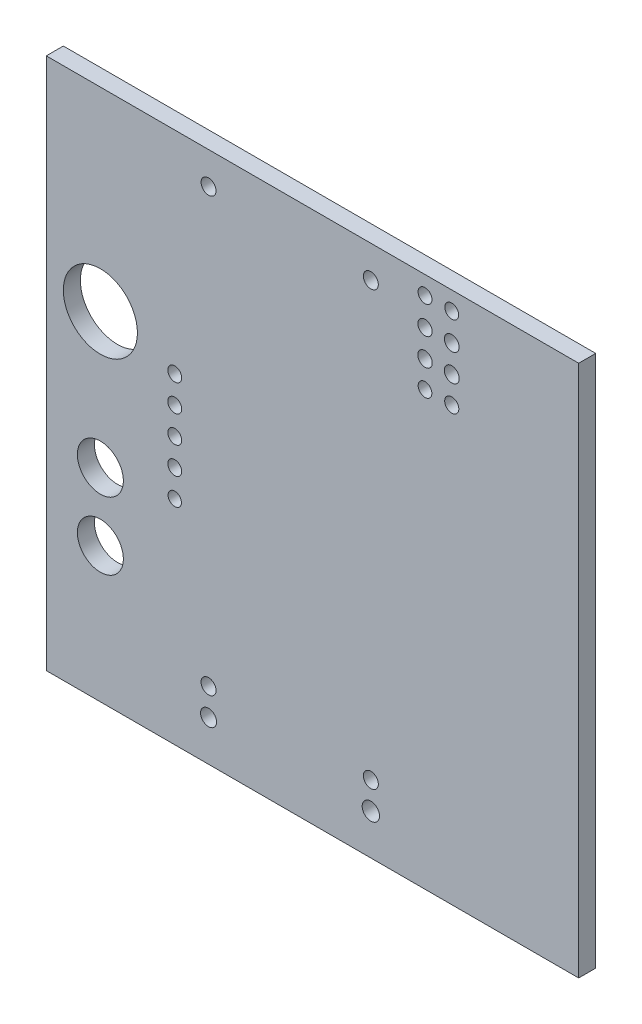
ISO-10303-21;
HEADER;
FILE_DESCRIPTION(('STEP AP214'),'2;1');
FILE_NAME('part.step','',(''),(''),'','','');
FILE_SCHEMA(('AUTOMOTIVE_DESIGN { 1 0 10303 214 1 1 1 1 }'));
ENDSEC;
DATA;
#1=APPLICATION_CONTEXT('core data for automotive mechanical design processes');
#2=APPLICATION_PROTOCOL_DEFINITION('international standard','automotive_design',2000,#1);
#3=PRODUCT_CONTEXT('',#1,'mechanical');
#4=PRODUCT('Part','Part','',(#3));
#5=PRODUCT_RELATED_PRODUCT_CATEGORY('part','',(#4));
#6=PRODUCT_DEFINITION_FORMATION('','',#4);
#7=PRODUCT_DEFINITION_CONTEXT('part definition',#1,'design');
#8=PRODUCT_DEFINITION('design','',#6,#7);
#9=PRODUCT_DEFINITION_SHAPE('','',#8);
#10=(LENGTH_UNIT() NAMED_UNIT(*) SI_UNIT(.MILLI.,.METRE.));
#11=(NAMED_UNIT(*) PLANE_ANGLE_UNIT() SI_UNIT($,.RADIAN.));
#12=(NAMED_UNIT(*) SI_UNIT($,.STERADIAN.) SOLID_ANGLE_UNIT());
#13=UNCERTAINTY_MEASURE_WITH_UNIT(LENGTH_MEASURE(1.E-05),#10,'distance_accuracy_value','');
#14=(GEOMETRIC_REPRESENTATION_CONTEXT(3) GLOBAL_UNCERTAINTY_ASSIGNED_CONTEXT((#13)) GLOBAL_UNIT_ASSIGNED_CONTEXT((#10,
#11,#12)) REPRESENTATION_CONTEXT('',''));
#15=CARTESIAN_POINT('',(0.,0.,0.));
#16=DIRECTION('',(0.,0.,1.));
#17=DIRECTION('',(1.,0.,0.));
#18=AXIS2_PLACEMENT_3D('',#15,#16,#17);
#19=CARTESIAN_POINT('',(0.,0.,1.6));
#20=DIRECTION('',(0.,0.,1.));
#21=DIRECTION('',(1.,0.,0.));
#22=AXIS2_PLACEMENT_3D('',#19,#20,#21);
#23=PLANE('',#22);
#24=CARTESIAN_POINT('',(30.48,3.81,1.6));
#25=DIRECTION('',(0.,0.,1.));
#26=DIRECTION('',(1.,0.,0.));
#27=AXIS2_PLACEMENT_3D('',#24,#25,#26);
#28=CIRCLE('',#27,0.813817080246663);
#29=CARTESIAN_POINT('',(31.2938170802467,3.81,1.6));
#30=VERTEX_POINT('',#29);
#31=EDGE_CURVE('E238',#30,#30,#28,.F.);
#32=ORIENTED_EDGE('',*,*,#31,.T.);
#33=EDGE_LOOP('',(#32));
#34=FACE_BOUND('',#33,.T.);
#35=CARTESIAN_POINT('',(15.24,3.81,1.6));
#36=DIRECTION('',(0.,0.,1.));
#37=DIRECTION('',(1.,0.,0.));
#38=AXIS2_PLACEMENT_3D('',#35,#36,#37);
#39=CIRCLE('',#38,0.75);
#40=CARTESIAN_POINT('',(15.99,3.81,1.6));
#41=VERTEX_POINT('',#40);
#42=EDGE_CURVE('E232',#41,#41,#39,.F.);
#43=ORIENTED_EDGE('',*,*,#42,.T.);
#44=EDGE_LOOP('',(#43));
#45=FACE_BOUND('',#44,.T.);
#46=CARTESIAN_POINT('',(15.24,46.99,1.6));
#47=DIRECTION('',(0.,0.,1.));
#48=DIRECTION('',(1.,0.,0.));
#49=AXIS2_PLACEMENT_3D('',#46,#47,#48);
#50=CIRCLE('',#49,0.704000000000003);
#51=CARTESIAN_POINT('',(15.944,46.99,1.6));
#52=VERTEX_POINT('',#51);
#53=EDGE_CURVE('E217',#52,#52,#50,.T.);
#54=ORIENTED_EDGE('',*,*,#53,.F.);
#55=EDGE_LOOP('',(#54));
#56=FACE_BOUND('',#55,.T.);
#57=CARTESIAN_POINT('',(15.24,6.35,1.6));
#58=DIRECTION('',(0.,0.,1.));
#59=DIRECTION('',(1.,0.,0.));
#60=AXIS2_PLACEMENT_3D('',#57,#58,#59);
#61=CIRCLE('',#60,0.704);
#62=CARTESIAN_POINT('',(15.944,6.35,1.6));
#63=VERTEX_POINT('',#62);
#64=EDGE_CURVE('E205',#63,#63,#61,.T.);
#65=ORIENTED_EDGE('',*,*,#64,.F.);
#66=EDGE_LOOP('',(#65));
#67=FACE_BOUND('',#66,.T.);
#68=CARTESIAN_POINT('',(5.08005587439719,12.6999582986829,1.6));
#69=DIRECTION('',(0.,0.,1.));
#70=DIRECTION('',(1.,0.,0.));
#71=AXIS2_PLACEMENT_3D('',#68,#69,#70);
#72=CIRCLE('',#71,2.1590419406458);
#73=CARTESIAN_POINT('',(7.23909781504299,12.6999582986829,1.6));
#74=VERTEX_POINT('',#73);
#75=EDGE_CURVE('E193',#74,#74,#72,.T.);
#76=ORIENTED_EDGE('',*,*,#75,.F.);
#77=EDGE_LOOP('',(#76));
#78=FACE_BOUND('',#77,.T.);
#79=CARTESIAN_POINT('',(12.065,20.0025,1.6));
#80=DIRECTION('',(0.,0.,1.));
#81=DIRECTION('',(1.,0.,0.));
#82=AXIS2_PLACEMENT_3D('',#79,#80,#81);
#83=CIRCLE('',#82,0.628256736205113);
#84=CARTESIAN_POINT('',(12.6932567362051,20.0025,1.6));
#85=VERTEX_POINT('',#84);
#86=EDGE_CURVE('E181',#85,#85,#83,.T.);
#87=ORIENTED_EDGE('',*,*,#86,.F.);
#88=EDGE_LOOP('',(#87));
#89=FACE_BOUND('',#88,.T.);
#90=CARTESIAN_POINT('',(12.065,27.6225,1.6));
#91=DIRECTION('',(0.,0.,1.));
#92=DIRECTION('',(1.,0.,0.));
#93=AXIS2_PLACEMENT_3D('',#90,#91,#92);
#94=CIRCLE('',#93,0.654);
#95=CARTESIAN_POINT('',(12.719,27.6225,1.6));
#96=VERTEX_POINT('',#95);
#97=EDGE_CURVE('E169',#96,#96,#94,.T.);
#98=ORIENTED_EDGE('',*,*,#97,.F.);
#99=EDGE_LOOP('',(#98));
#100=FACE_BOUND('',#99,.T.);
#101=CARTESIAN_POINT('',(12.065,22.5425,1.6));
#102=DIRECTION('',(0.,0.,1.));
#103=DIRECTION('',(1.,0.,0.));
#104=AXIS2_PLACEMENT_3D('',#101,#102,#103);
#105=CIRCLE('',#104,0.653999999999999);
#106=CARTESIAN_POINT('',(12.719,22.5425,1.6));
#107=VERTEX_POINT('',#106);
#108=EDGE_CURVE('E157',#107,#107,#105,.T.);
#109=ORIENTED_EDGE('',*,*,#108,.F.);
#110=EDGE_LOOP('',(#109));
#111=FACE_BOUND('',#110,.T.);
#112=CARTESIAN_POINT('',(35.5673174372232,45.6860727150293,1.6));
#113=DIRECTION('',(0.,0.,1.));
#114=DIRECTION('',(1.,0.,0.));
#115=AXIS2_PLACEMENT_3D('',#112,#113,#114);
#116=CIRCLE('',#115,0.672816827078109);
#117=CARTESIAN_POINT('',(36.2401342643014,45.6860727150293,1.6));
#118=VERTEX_POINT('',#117);
#119=EDGE_CURVE('E145',#118,#118,#116,.T.);
#120=ORIENTED_EDGE('',*,*,#119,.F.);
#121=EDGE_LOOP('',(#120));
#122=FACE_BOUND('',#121,.T.);
#123=CARTESIAN_POINT('',(35.5673174372232,40.6473174372233,1.6));
#124=DIRECTION('',(0.,0.,1.));
#125=DIRECTION('',(1.,0.,0.));
#126=AXIS2_PLACEMENT_3D('',#123,#124,#125);
#127=CIRCLE('',#126,0.64364530914697);
#128=CARTESIAN_POINT('',(36.2109627463702,40.6473174372233,1.6));
#129=VERTEX_POINT('',#128);
#130=EDGE_CURVE('E133',#129,#129,#127,.T.);
#131=ORIENTED_EDGE('',*,*,#130,.F.);
#132=EDGE_LOOP('',(#131));
#133=FACE_BOUND('',#132,.T.);
#134=CARTESIAN_POINT('',(38.078780302252,43.1350422466672,1.6));
#135=DIRECTION('',(0.,0.,1.));
#136=DIRECTION('',(1.,0.,0.));
#137=AXIS2_PLACEMENT_3D('',#134,#135,#136);
#138=CIRCLE('',#137,0.700788252530769);
#139=CARTESIAN_POINT('',(38.7795685547828,43.1350422466672,1.6));
#140=VERTEX_POINT('',#139);
#141=EDGE_CURVE('E121',#140,#140,#138,.T.);
#142=ORIENTED_EDGE('',*,*,#141,.F.);
#143=EDGE_LOOP('',(#142));
#144=FACE_BOUND('',#143,.T.);
#145=CARTESIAN_POINT('',(38.078780302252,48.281219697748,1.6));
#146=DIRECTION('',(0.,0.,1.));
#147=DIRECTION('',(1.,0.,0.));
#148=AXIS2_PLACEMENT_3D('',#145,#146,#147);
#149=CIRCLE('',#148,0.653993728109937);
#150=CARTESIAN_POINT('',(38.732774030362,48.281219697748,1.6));
#151=VERTEX_POINT('',#150);
#152=EDGE_CURVE('E100',#151,#151,#149,.T.);
#153=ORIENTED_EDGE('',*,*,#152,.F.);
#154=EDGE_LOOP('',(#153));
#155=FACE_BOUND('',#154,.T.);
#156=DIRECTION('',(0.,-1.,0.));
#157=VECTOR('',#156,1.);
#158=CARTESIAN_POINT('',(0.,50.,1.6));
#159=LINE('',#158,#157);
#160=CARTESIAN_POINT('',(0.,50.,1.6));
#161=VERTEX_POINT('',#160);
#162=CARTESIAN_POINT('',(0.,0.,1.6));
#163=VERTEX_POINT('',#162);
#164=EDGE_CURVE('E85',#161,#163,#159,.T.);
#165=ORIENTED_EDGE('',*,*,#164,.T.);
#166=DIRECTION('',(1.,0.,0.));
#167=VECTOR('',#166,1.);
#168=CARTESIAN_POINT('',(0.,0.,1.6));
#169=LINE('',#168,#167);
#170=CARTESIAN_POINT('',(50.,0.,1.6));
#171=VERTEX_POINT('',#170);
#172=EDGE_CURVE('E80',#163,#171,#169,.T.);
#173=ORIENTED_EDGE('',*,*,#172,.T.);
#174=DIRECTION('',(0.,1.,0.));
#175=VECTOR('',#174,1.);
#176=CARTESIAN_POINT('',(50.,50.,1.6));
#177=LINE('',#176,#175);
#178=CARTESIAN_POINT('',(50.,50.,1.6));
#179=VERTEX_POINT('',#178);
#180=EDGE_CURVE('E83',#171,#179,#177,.T.);
#181=ORIENTED_EDGE('',*,*,#180,.T.);
#182=DIRECTION('',(-1.,0.,0.));
#183=VECTOR('',#182,1.);
#184=CARTESIAN_POINT('',(0.,50.,1.6));
#185=LINE('',#184,#183);
#186=EDGE_CURVE('E50',#179,#161,#185,.T.);
#187=ORIENTED_EDGE('',*,*,#186,.T.);
#188=EDGE_LOOP('',(#165,#173,#181,#187));
#189=FACE_BOUND('',#188,.T.);
#190=CARTESIAN_POINT('',(38.078780302252,45.6860727150293,1.6));
#191=DIRECTION('',(0.,0.,1.));
#192=DIRECTION('',(1.,0.,0.));
#193=AXIS2_PLACEMENT_3D('',#190,#191,#192);
#194=CIRCLE('',#193,0.692988533552268);
#195=CARTESIAN_POINT('',(38.7717688358043,45.6860727150293,1.6));
#196=VERTEX_POINT('',#195);
#197=EDGE_CURVE('E115',#196,#196,#194,.T.);
#198=ORIENTED_EDGE('',*,*,#197,.F.);
#199=EDGE_LOOP('',(#198));
#200=FACE_BOUND('',#199,.T.);
#201=CARTESIAN_POINT('',(38.078780302252,40.6473174372233,1.6));
#202=DIRECTION('',(0.,0.,1.));
#203=DIRECTION('',(1.,0.,0.));
#204=AXIS2_PLACEMENT_3D('',#201,#202,#203);
#205=CIRCLE('',#204,0.663824110800747);
#206=CARTESIAN_POINT('',(38.7426044130528,40.6473174372233,1.6));
#207=VERTEX_POINT('',#206);
#208=EDGE_CURVE('E127',#207,#207,#205,.T.);
#209=ORIENTED_EDGE('',*,*,#208,.F.);
#210=EDGE_LOOP('',(#209));
#211=FACE_BOUND('',#210,.T.);
#212=CARTESIAN_POINT('',(35.5673174372232,43.1350422466672,1.6));
#213=DIRECTION('',(0.,0.,1.));
#214=DIRECTION('',(1.,0.,0.));
#215=AXIS2_PLACEMENT_3D('',#212,#213,#214);
#216=CIRCLE('',#215,0.680609450876977);
#217=CARTESIAN_POINT('',(36.2479268881002,43.1350422466672,1.6));
#218=VERTEX_POINT('',#217);
#219=EDGE_CURVE('E139',#218,#218,#216,.T.);
#220=ORIENTED_EDGE('',*,*,#219,.F.);
#221=EDGE_LOOP('',(#220));
#222=FACE_BOUND('',#221,.T.);
#223=CARTESIAN_POINT('',(35.5673174372232,48.281219697748,1.6));
#224=DIRECTION('',(0.,0.,1.));
#225=DIRECTION('',(1.,0.,0.));
#226=AXIS2_PLACEMENT_3D('',#223,#224,#225);
#227=CIRCLE('',#226,0.653359990632854);
#228=CARTESIAN_POINT('',(36.2206774278561,48.281219697748,1.6));
#229=VERTEX_POINT('',#228);
#230=EDGE_CURVE('E151',#229,#229,#227,.T.);
#231=ORIENTED_EDGE('',*,*,#230,.F.);
#232=EDGE_LOOP('',(#231));
#233=FACE_BOUND('',#232,.T.);
#234=CARTESIAN_POINT('',(12.065,25.0825,1.6));
#235=DIRECTION('',(0.,0.,1.));
#236=DIRECTION('',(1.,0.,0.));
#237=AXIS2_PLACEMENT_3D('',#234,#235,#236);
#238=CIRCLE('',#237,0.653999999999999);
#239=CARTESIAN_POINT('',(12.719,25.0825,1.6));
#240=VERTEX_POINT('',#239);
#241=EDGE_CURVE('E163',#240,#240,#238,.T.);
#242=ORIENTED_EDGE('',*,*,#241,.F.);
#243=EDGE_LOOP('',(#242));
#244=FACE_BOUND('',#243,.T.);
#245=CARTESIAN_POINT('',(12.065,30.1625,1.6));
#246=DIRECTION('',(0.,0.,1.));
#247=DIRECTION('',(1.,0.,0.));
#248=AXIS2_PLACEMENT_3D('',#245,#246,#247);
#249=CIRCLE('',#248,0.654);
#250=CARTESIAN_POINT('',(12.719,30.1625,1.6));
#251=VERTEX_POINT('',#250);
#252=EDGE_CURVE('E175',#251,#251,#249,.T.);
#253=ORIENTED_EDGE('',*,*,#252,.F.);
#254=EDGE_LOOP('',(#253));
#255=FACE_BOUND('',#254,.T.);
#256=CARTESIAN_POINT('',(5.08018454865011,19.0497391682505,1.6));
#257=DIRECTION('',(0.,0.,1.));
#258=DIRECTION('',(1.,0.,0.));
#259=AXIS2_PLACEMENT_3D('',#256,#257,#258);
#260=CIRCLE('',#259,2.15927998007335);
#261=CARTESIAN_POINT('',(7.23946452872346,19.0497391682505,1.6));
#262=VERTEX_POINT('',#261);
#263=EDGE_CURVE('E187',#262,#262,#260,.T.);
#264=ORIENTED_EDGE('',*,*,#263,.F.);
#265=EDGE_LOOP('',(#264));
#266=FACE_BOUND('',#265,.T.);
#267=CARTESIAN_POINT('',(5.08,31.75,1.6));
#268=DIRECTION('',(0.,0.,1.));
#269=DIRECTION('',(1.,0.,0.));
#270=AXIS2_PLACEMENT_3D('',#267,#268,#269);
#271=CIRCLE('',#270,3.4798);
#272=CARTESIAN_POINT('',(8.5598,31.75,1.6));
#273=VERTEX_POINT('',#272);
#274=EDGE_CURVE('E199',#273,#273,#271,.T.);
#275=ORIENTED_EDGE('',*,*,#274,.F.);
#276=EDGE_LOOP('',(#275));
#277=FACE_BOUND('',#276,.T.);
#278=CARTESIAN_POINT('',(30.48,6.35,1.6));
#279=DIRECTION('',(0.,0.,1.));
#280=DIRECTION('',(1.,0.,0.));
#281=AXIS2_PLACEMENT_3D('',#278,#279,#280);
#282=CIRCLE('',#281,0.704);
#283=CARTESIAN_POINT('',(31.184,6.35,1.6));
#284=VERTEX_POINT('',#283);
#285=EDGE_CURVE('E211',#284,#284,#282,.T.);
#286=ORIENTED_EDGE('',*,*,#285,.F.);
#287=EDGE_LOOP('',(#286));
#288=FACE_BOUND('',#287,.T.);
#289=CARTESIAN_POINT('',(30.48,46.99,1.6));
#290=DIRECTION('',(0.,0.,1.));
#291=DIRECTION('',(1.,0.,0.));
#292=AXIS2_PLACEMENT_3D('',#289,#290,#291);
#293=CIRCLE('',#292,0.703999999999996);
#294=CARTESIAN_POINT('',(31.184,46.99,1.6));
#295=VERTEX_POINT('',#294);
#296=EDGE_CURVE('E223',#295,#295,#293,.T.);
#297=ORIENTED_EDGE('',*,*,#296,.F.);
#298=EDGE_LOOP('',(#297));
#299=FACE_BOUND('',#298,.T.);
#300=ADVANCED_FACE('F33',(#34,#45,#56,#67,#78,#89,#100,#111,#122,#133,#144,#155,#189,#200,#211,
#222,#233,#244,#255,#266,#277,#288,#299),#23,.T.);
#301=CARTESIAN_POINT('',(0.,0.,0.));
#302=DIRECTION('',(0.,0.,1.));
#303=DIRECTION('',(1.,0.,0.));
#304=AXIS2_PLACEMENT_3D('',#301,#302,#303);
#305=PLANE('',#304);
#306=CARTESIAN_POINT('',(30.48,3.81,0.));
#307=DIRECTION('',(0.,0.,-1.));
#308=DIRECTION('',(-1.,0.,0.));
#309=AXIS2_PLACEMENT_3D('',#306,#307,#308);
#310=CIRCLE('',#309,0.813817080246663);
#311=CARTESIAN_POINT('',(29.6661829197533,3.81,0.));
#312=VERTEX_POINT('',#311);
#313=EDGE_CURVE('E235',#312,#312,#310,.T.);
#314=ORIENTED_EDGE('',*,*,#313,.F.);
#315=EDGE_LOOP('',(#314));
#316=FACE_BOUND('',#315,.T.);
#317=CARTESIAN_POINT('',(15.24,3.81,0.));
#318=DIRECTION('',(0.,0.,-1.));
#319=DIRECTION('',(-1.,0.,0.));
#320=AXIS2_PLACEMENT_3D('',#317,#318,#319);
#321=CIRCLE('',#320,0.75);
#322=CARTESIAN_POINT('',(14.49,3.81,0.));
#323=VERTEX_POINT('',#322);
#324=EDGE_CURVE('E229',#323,#323,#321,.T.);
#325=ORIENTED_EDGE('',*,*,#324,.F.);
#326=EDGE_LOOP('',(#325));
#327=FACE_BOUND('',#326,.T.);
#328=CARTESIAN_POINT('',(15.24,46.99,0.));
#329=DIRECTION('',(0.,0.,1.));
#330=DIRECTION('',(1.,0.,0.));
#331=AXIS2_PLACEMENT_3D('',#328,#329,#330);
#332=CIRCLE('',#331,0.704000000000003);
#333=CARTESIAN_POINT('',(15.944,46.99,0.));
#334=VERTEX_POINT('',#333);
#335=EDGE_CURVE('E220',#334,#334,#332,.T.);
#336=ORIENTED_EDGE('',*,*,#335,.T.);
#337=EDGE_LOOP('',(#336));
#338=FACE_BOUND('',#337,.T.);
#339=CARTESIAN_POINT('',(15.24,6.35,0.));
#340=DIRECTION('',(0.,0.,1.));
#341=DIRECTION('',(1.,0.,0.));
#342=AXIS2_PLACEMENT_3D('',#339,#340,#341);
#343=CIRCLE('',#342,0.704);
#344=CARTESIAN_POINT('',(15.944,6.35,0.));
#345=VERTEX_POINT('',#344);
#346=EDGE_CURVE('E208',#345,#345,#343,.T.);
#347=ORIENTED_EDGE('',*,*,#346,.T.);
#348=EDGE_LOOP('',(#347));
#349=FACE_BOUND('',#348,.T.);
#350=CARTESIAN_POINT('',(5.08005587439719,12.6999582986829,0.));
#351=DIRECTION('',(0.,0.,1.));
#352=DIRECTION('',(1.,0.,0.));
#353=AXIS2_PLACEMENT_3D('',#350,#351,#352);
#354=CIRCLE('',#353,2.1590419406458);
#355=CARTESIAN_POINT('',(7.23909781504299,12.6999582986829,0.));
#356=VERTEX_POINT('',#355);
#357=EDGE_CURVE('E196',#356,#356,#354,.T.);
#358=ORIENTED_EDGE('',*,*,#357,.T.);
#359=EDGE_LOOP('',(#358));
#360=FACE_BOUND('',#359,.T.);
#361=CARTESIAN_POINT('',(12.065,20.0025,0.));
#362=DIRECTION('',(0.,0.,1.));
#363=DIRECTION('',(1.,0.,0.));
#364=AXIS2_PLACEMENT_3D('',#361,#362,#363);
#365=CIRCLE('',#364,0.628256736205113);
#366=CARTESIAN_POINT('',(12.6932567362051,20.0025,0.));
#367=VERTEX_POINT('',#366);
#368=EDGE_CURVE('E184',#367,#367,#365,.T.);
#369=ORIENTED_EDGE('',*,*,#368,.T.);
#370=EDGE_LOOP('',(#369));
#371=FACE_BOUND('',#370,.T.);
#372=CARTESIAN_POINT('',(12.065,27.6225,0.));
#373=DIRECTION('',(0.,0.,1.));
#374=DIRECTION('',(1.,0.,0.));
#375=AXIS2_PLACEMENT_3D('',#372,#373,#374);
#376=CIRCLE('',#375,0.654);
#377=CARTESIAN_POINT('',(12.719,27.6225,0.));
#378=VERTEX_POINT('',#377);
#379=EDGE_CURVE('E172',#378,#378,#376,.T.);
#380=ORIENTED_EDGE('',*,*,#379,.T.);
#381=EDGE_LOOP('',(#380));
#382=FACE_BOUND('',#381,.T.);
#383=CARTESIAN_POINT('',(12.065,22.5425,0.));
#384=DIRECTION('',(0.,0.,1.));
#385=DIRECTION('',(1.,0.,0.));
#386=AXIS2_PLACEMENT_3D('',#383,#384,#385);
#387=CIRCLE('',#386,0.653999999999999);
#388=CARTESIAN_POINT('',(12.719,22.5425,0.));
#389=VERTEX_POINT('',#388);
#390=EDGE_CURVE('E160',#389,#389,#387,.T.);
#391=ORIENTED_EDGE('',*,*,#390,.T.);
#392=EDGE_LOOP('',(#391));
#393=FACE_BOUND('',#392,.T.);
#394=CARTESIAN_POINT('',(35.5673174372232,45.6860727150293,0.));
#395=DIRECTION('',(0.,0.,1.));
#396=DIRECTION('',(1.,0.,0.));
#397=AXIS2_PLACEMENT_3D('',#394,#395,#396);
#398=CIRCLE('',#397,0.672816827078109);
#399=CARTESIAN_POINT('',(36.2401342643014,45.6860727150293,0.));
#400=VERTEX_POINT('',#399);
#401=EDGE_CURVE('E148',#400,#400,#398,.T.);
#402=ORIENTED_EDGE('',*,*,#401,.T.);
#403=EDGE_LOOP('',(#402));
#404=FACE_BOUND('',#403,.T.);
#405=CARTESIAN_POINT('',(35.5673174372232,40.6473174372233,0.));
#406=DIRECTION('',(0.,0.,1.));
#407=DIRECTION('',(1.,0.,0.));
#408=AXIS2_PLACEMENT_3D('',#405,#406,#407);
#409=CIRCLE('',#408,0.64364530914697);
#410=CARTESIAN_POINT('',(36.2109627463702,40.6473174372233,0.));
#411=VERTEX_POINT('',#410);
#412=EDGE_CURVE('E136',#411,#411,#409,.T.);
#413=ORIENTED_EDGE('',*,*,#412,.T.);
#414=EDGE_LOOP('',(#413));
#415=FACE_BOUND('',#414,.T.);
#416=CARTESIAN_POINT('',(38.078780302252,43.1350422466672,0.));
#417=DIRECTION('',(0.,0.,1.));
#418=DIRECTION('',(1.,0.,0.));
#419=AXIS2_PLACEMENT_3D('',#416,#417,#418);
#420=CIRCLE('',#419,0.700788252530769);
#421=CARTESIAN_POINT('',(38.7795685547828,43.1350422466672,0.));
#422=VERTEX_POINT('',#421);
#423=EDGE_CURVE('E124',#422,#422,#420,.T.);
#424=ORIENTED_EDGE('',*,*,#423,.T.);
#425=EDGE_LOOP('',(#424));
#426=FACE_BOUND('',#425,.T.);
#427=CARTESIAN_POINT('',(38.078780302252,48.281219697748,0.));
#428=DIRECTION('',(0.,0.,1.));
#429=DIRECTION('',(1.,0.,0.));
#430=AXIS2_PLACEMENT_3D('',#427,#428,#429);
#431=CIRCLE('',#430,0.653993728109937);
#432=CARTESIAN_POINT('',(38.732774030362,48.281219697748,0.));
#433=VERTEX_POINT('',#432);
#434=EDGE_CURVE('E112',#433,#433,#431,.T.);
#435=ORIENTED_EDGE('',*,*,#434,.T.);
#436=EDGE_LOOP('',(#435));
#437=FACE_BOUND('',#436,.T.);
#438=DIRECTION('',(0.,-1.,0.));
#439=VECTOR('',#438,1.);
#440=CARTESIAN_POINT('',(0.,50.,0.));
#441=LINE('',#440,#439);
#442=CARTESIAN_POINT('',(0.,50.,0.));
#443=VERTEX_POINT('',#442);
#444=CARTESIAN_POINT('',(0.,0.,0.));
#445=VERTEX_POINT('',#444);
#446=EDGE_CURVE('E97',#443,#445,#441,.T.);
#447=ORIENTED_EDGE('',*,*,#446,.F.);
#448=DIRECTION('',(-1.,0.,0.));
#449=VECTOR('',#448,1.);
#450=CARTESIAN_POINT('',(0.,50.,0.));
#451=LINE('',#450,#449);
#452=CARTESIAN_POINT('',(50.,50.,0.));
#453=VERTEX_POINT('',#452);
#454=EDGE_CURVE('E73',#453,#443,#451,.T.);
#455=ORIENTED_EDGE('',*,*,#454,.F.);
#456=DIRECTION('',(0.,1.,0.));
#457=VECTOR('',#456,1.);
#458=CARTESIAN_POINT('',(50.,50.,0.));
#459=LINE('',#458,#457);
#460=CARTESIAN_POINT('',(50.,0.,0.));
#461=VERTEX_POINT('',#460);
#462=EDGE_CURVE('E67',#461,#453,#459,.T.);
#463=ORIENTED_EDGE('',*,*,#462,.F.);
#464=DIRECTION('',(1.,0.,0.));
#465=VECTOR('',#464,1.);
#466=CARTESIAN_POINT('',(0.,0.,0.));
#467=LINE('',#466,#465);
#468=EDGE_CURVE('E89',#445,#461,#467,.T.);
#469=ORIENTED_EDGE('',*,*,#468,.F.);
#470=EDGE_LOOP('',(#447,#455,#463,#469));
#471=FACE_BOUND('',#470,.T.);
#472=CARTESIAN_POINT('',(38.078780302252,45.6860727150293,0.));
#473=DIRECTION('',(0.,0.,1.));
#474=DIRECTION('',(1.,0.,0.));
#475=AXIS2_PLACEMENT_3D('',#472,#473,#474);
#476=CIRCLE('',#475,0.692988533552268);
#477=CARTESIAN_POINT('',(38.7717688358043,45.6860727150293,0.));
#478=VERTEX_POINT('',#477);
#479=EDGE_CURVE('E118',#478,#478,#476,.T.);
#480=ORIENTED_EDGE('',*,*,#479,.T.);
#481=EDGE_LOOP('',(#480));
#482=FACE_BOUND('',#481,.T.);
#483=CARTESIAN_POINT('',(38.078780302252,40.6473174372233,0.));
#484=DIRECTION('',(0.,0.,1.));
#485=DIRECTION('',(1.,0.,0.));
#486=AXIS2_PLACEMENT_3D('',#483,#484,#485);
#487=CIRCLE('',#486,0.663824110800747);
#488=CARTESIAN_POINT('',(38.7426044130528,40.6473174372233,0.));
#489=VERTEX_POINT('',#488);
#490=EDGE_CURVE('E130',#489,#489,#487,.T.);
#491=ORIENTED_EDGE('',*,*,#490,.T.);
#492=EDGE_LOOP('',(#491));
#493=FACE_BOUND('',#492,.T.);
#494=CARTESIAN_POINT('',(35.5673174372232,43.1350422466672,0.));
#495=DIRECTION('',(0.,0.,1.));
#496=DIRECTION('',(1.,0.,0.));
#497=AXIS2_PLACEMENT_3D('',#494,#495,#496);
#498=CIRCLE('',#497,0.680609450876977);
#499=CARTESIAN_POINT('',(36.2479268881002,43.1350422466672,0.));
#500=VERTEX_POINT('',#499);
#501=EDGE_CURVE('E142',#500,#500,#498,.T.);
#502=ORIENTED_EDGE('',*,*,#501,.T.);
#503=EDGE_LOOP('',(#502));
#504=FACE_BOUND('',#503,.T.);
#505=CARTESIAN_POINT('',(35.5673174372232,48.281219697748,0.));
#506=DIRECTION('',(0.,0.,1.));
#507=DIRECTION('',(1.,0.,0.));
#508=AXIS2_PLACEMENT_3D('',#505,#506,#507);
#509=CIRCLE('',#508,0.653359990632854);
#510=CARTESIAN_POINT('',(36.2206774278561,48.281219697748,0.));
#511=VERTEX_POINT('',#510);
#512=EDGE_CURVE('E154',#511,#511,#509,.T.);
#513=ORIENTED_EDGE('',*,*,#512,.T.);
#514=EDGE_LOOP('',(#513));
#515=FACE_BOUND('',#514,.T.);
#516=CARTESIAN_POINT('',(12.065,25.0825,0.));
#517=DIRECTION('',(0.,0.,1.));
#518=DIRECTION('',(1.,0.,0.));
#519=AXIS2_PLACEMENT_3D('',#516,#517,#518);
#520=CIRCLE('',#519,0.653999999999999);
#521=CARTESIAN_POINT('',(12.719,25.0825,0.));
#522=VERTEX_POINT('',#521);
#523=EDGE_CURVE('E166',#522,#522,#520,.T.);
#524=ORIENTED_EDGE('',*,*,#523,.T.);
#525=EDGE_LOOP('',(#524));
#526=FACE_BOUND('',#525,.T.);
#527=CARTESIAN_POINT('',(12.065,30.1625,0.));
#528=DIRECTION('',(0.,0.,1.));
#529=DIRECTION('',(1.,0.,0.));
#530=AXIS2_PLACEMENT_3D('',#527,#528,#529);
#531=CIRCLE('',#530,0.654);
#532=CARTESIAN_POINT('',(12.719,30.1625,0.));
#533=VERTEX_POINT('',#532);
#534=EDGE_CURVE('E178',#533,#533,#531,.T.);
#535=ORIENTED_EDGE('',*,*,#534,.T.);
#536=EDGE_LOOP('',(#535));
#537=FACE_BOUND('',#536,.T.);
#538=CARTESIAN_POINT('',(5.08018454865011,19.0497391682505,0.));
#539=DIRECTION('',(0.,0.,1.));
#540=DIRECTION('',(1.,0.,0.));
#541=AXIS2_PLACEMENT_3D('',#538,#539,#540);
#542=CIRCLE('',#541,2.15927998007335);
#543=CARTESIAN_POINT('',(7.23946452872346,19.0497391682505,0.));
#544=VERTEX_POINT('',#543);
#545=EDGE_CURVE('E190',#544,#544,#542,.T.);
#546=ORIENTED_EDGE('',*,*,#545,.T.);
#547=EDGE_LOOP('',(#546));
#548=FACE_BOUND('',#547,.T.);
#549=CARTESIAN_POINT('',(5.08,31.75,0.));
#550=DIRECTION('',(0.,0.,1.));
#551=DIRECTION('',(1.,0.,0.));
#552=AXIS2_PLACEMENT_3D('',#549,#550,#551);
#553=CIRCLE('',#552,3.4798);
#554=CARTESIAN_POINT('',(8.5598,31.75,0.));
#555=VERTEX_POINT('',#554);
#556=EDGE_CURVE('E202',#555,#555,#553,.T.);
#557=ORIENTED_EDGE('',*,*,#556,.T.);
#558=EDGE_LOOP('',(#557));
#559=FACE_BOUND('',#558,.T.);
#560=CARTESIAN_POINT('',(30.48,6.35,0.));
#561=DIRECTION('',(0.,0.,1.));
#562=DIRECTION('',(1.,0.,0.));
#563=AXIS2_PLACEMENT_3D('',#560,#561,#562);
#564=CIRCLE('',#563,0.704);
#565=CARTESIAN_POINT('',(31.184,6.35,0.));
#566=VERTEX_POINT('',#565);
#567=EDGE_CURVE('E214',#566,#566,#564,.T.);
#568=ORIENTED_EDGE('',*,*,#567,.T.);
#569=EDGE_LOOP('',(#568));
#570=FACE_BOUND('',#569,.T.);
#571=CARTESIAN_POINT('',(30.48,46.99,0.));
#572=DIRECTION('',(0.,0.,1.));
#573=DIRECTION('',(1.,0.,0.));
#574=AXIS2_PLACEMENT_3D('',#571,#572,#573);
#575=CIRCLE('',#574,0.703999999999996);
#576=CARTESIAN_POINT('',(31.184,46.99,0.));
#577=VERTEX_POINT('',#576);
#578=EDGE_CURVE('E226',#577,#577,#575,.T.);
#579=ORIENTED_EDGE('',*,*,#578,.T.);
#580=EDGE_LOOP('',(#579));
#581=FACE_BOUND('',#580,.T.);
#582=ADVANCED_FACE('F108',(#316,#327,#338,#349,#360,#371,#382,#393,#404,#415,#426,#437,#471,
#482,#493,#504,#515,#526,#537,#548,#559,#570,#581),#305,.F.);
#583=CARTESIAN_POINT('',(0.,50.,1.6));
#584=DIRECTION('',(1.,0.,0.));
#585=DIRECTION('',(0.,0.,-1.));
#586=AXIS2_PLACEMENT_3D('',#583,#584,#585);
#587=PLANE('',#586);
#588=ORIENTED_EDGE('',*,*,#446,.T.);
#589=DIRECTION('',(0.,0.,-1.));
#590=VECTOR('',#589,1.);
#591=CARTESIAN_POINT('',(0.,0.,1.6));
#592=LINE('',#591,#590);
#593=EDGE_CURVE('E11',#163,#445,#592,.T.);
#594=ORIENTED_EDGE('',*,*,#593,.F.);
#595=ORIENTED_EDGE('',*,*,#164,.F.);
#596=DIRECTION('',(0.,0.,-1.));
#597=VECTOR('',#596,1.);
#598=CARTESIAN_POINT('',(0.,50.,1.6));
#599=LINE('',#598,#597);
#600=EDGE_CURVE('E93',#161,#443,#599,.T.);
#601=ORIENTED_EDGE('',*,*,#600,.T.);
#602=EDGE_LOOP('',(#588,#594,#595,#601));
#603=FACE_BOUND('',#602,.T.);
#604=ADVANCED_FACE('F35',(#603),#587,.F.);
#605=CARTESIAN_POINT('',(0.,0.,1.6));
#606=DIRECTION('',(0.,1.,0.));
#607=DIRECTION('',(0.,0.,1.));
#608=AXIS2_PLACEMENT_3D('',#605,#606,#607);
#609=PLANE('',#608);
#610=ORIENTED_EDGE('',*,*,#468,.T.);
#611=DIRECTION('',(0.,0.,-1.));
#612=VECTOR('',#611,1.);
#613=CARTESIAN_POINT('',(50.,0.,1.6));
#614=LINE('',#613,#612);
#615=EDGE_CURVE('E42',#171,#461,#614,.T.);
#616=ORIENTED_EDGE('',*,*,#615,.F.);
#617=ORIENTED_EDGE('',*,*,#172,.F.);
#618=ORIENTED_EDGE('',*,*,#593,.T.);
#619=EDGE_LOOP('',(#610,#616,#617,#618));
#620=FACE_BOUND('',#619,.T.);
#621=ADVANCED_FACE('F88',(#620),#609,.F.);
#622=CARTESIAN_POINT('',(50.,50.,1.6));
#623=DIRECTION('',(-1.,0.,0.));
#624=DIRECTION('',(0.,0.,1.));
#625=AXIS2_PLACEMENT_3D('',#622,#623,#624);
#626=PLANE('',#625);
#627=ORIENTED_EDGE('',*,*,#462,.T.);
#628=DIRECTION('',(0.,0.,-1.));
#629=VECTOR('',#628,1.);
#630=CARTESIAN_POINT('',(50.,50.,1.6));
#631=LINE('',#630,#629);
#632=EDGE_CURVE('E90',#179,#453,#631,.T.);
#633=ORIENTED_EDGE('',*,*,#632,.F.);
#634=ORIENTED_EDGE('',*,*,#180,.F.);
#635=ORIENTED_EDGE('',*,*,#615,.T.);
#636=EDGE_LOOP('',(#627,#633,#634,#635));
#637=FACE_BOUND('',#636,.T.);
#638=ADVANCED_FACE('F91',(#637),#626,.F.);
#639=CARTESIAN_POINT('',(0.,50.,1.6));
#640=DIRECTION('',(0.,-1.,0.));
#641=DIRECTION('',(0.,0.,-1.));
#642=AXIS2_PLACEMENT_3D('',#639,#640,#641);
#643=PLANE('',#642);
#644=ORIENTED_EDGE('',*,*,#454,.T.);
#645=ORIENTED_EDGE('',*,*,#600,.F.);
#646=ORIENTED_EDGE('',*,*,#186,.F.);
#647=ORIENTED_EDGE('',*,*,#632,.T.);
#648=EDGE_LOOP('',(#644,#645,#646,#647));
#649=FACE_BOUND('',#648,.T.);
#650=ADVANCED_FACE('F105',(#649),#643,.F.);
#651=CARTESIAN_POINT('',(38.078780302252,48.281219697748,1.6));
#652=DIRECTION('',(0.,0.,-1.));
#653=DIRECTION('',(-1.,0.,0.));
#654=AXIS2_PLACEMENT_3D('',#651,#652,#653);
#655=CYLINDRICAL_SURFACE('',#654,0.653993728109937);
#656=ORIENTED_EDGE('',*,*,#152,.T.);
#657=EDGE_LOOP('',(#656));
#658=FACE_BOUND('',#657,.T.);
#659=ORIENTED_EDGE('',*,*,#434,.F.);
#660=EDGE_LOOP('',(#659));
#661=FACE_BOUND('',#660,.T.);
#662=ADVANCED_FACE('F271',(#658,#661),#655,.F.);
#663=CARTESIAN_POINT('',(38.078780302252,45.6860727150293,1.6));
#664=DIRECTION('',(0.,0.,-1.));
#665=DIRECTION('',(-1.,0.,0.));
#666=AXIS2_PLACEMENT_3D('',#663,#664,#665);
#667=CYLINDRICAL_SURFACE('',#666,0.692988533552268);
#668=ORIENTED_EDGE('',*,*,#197,.T.);
#669=EDGE_LOOP('',(#668));
#670=FACE_BOUND('',#669,.T.);
#671=ORIENTED_EDGE('',*,*,#479,.F.);
#672=EDGE_LOOP('',(#671));
#673=FACE_BOUND('',#672,.T.);
#674=ADVANCED_FACE('F273',(#670,#673),#667,.F.);
#675=CARTESIAN_POINT('',(38.078780302252,43.1350422466672,1.6));
#676=DIRECTION('',(0.,0.,-1.));
#677=DIRECTION('',(-1.,0.,0.));
#678=AXIS2_PLACEMENT_3D('',#675,#676,#677);
#679=CYLINDRICAL_SURFACE('',#678,0.700788252530769);
#680=ORIENTED_EDGE('',*,*,#141,.T.);
#681=EDGE_LOOP('',(#680));
#682=FACE_BOUND('',#681,.T.);
#683=ORIENTED_EDGE('',*,*,#423,.F.);
#684=EDGE_LOOP('',(#683));
#685=FACE_BOUND('',#684,.T.);
#686=ADVANCED_FACE('F280',(#682,#685),#679,.F.);
#687=CARTESIAN_POINT('',(38.078780302252,40.6473174372233,1.6));
#688=DIRECTION('',(0.,0.,-1.));
#689=DIRECTION('',(-1.,0.,0.));
#690=AXIS2_PLACEMENT_3D('',#687,#688,#689);
#691=CYLINDRICAL_SURFACE('',#690,0.663824110800747);
#692=ORIENTED_EDGE('',*,*,#208,.T.);
#693=EDGE_LOOP('',(#692));
#694=FACE_BOUND('',#693,.T.);
#695=ORIENTED_EDGE('',*,*,#490,.F.);
#696=EDGE_LOOP('',(#695));
#697=FACE_BOUND('',#696,.T.);
#698=ADVANCED_FACE('F396',(#694,#697),#691,.F.);
#699=CARTESIAN_POINT('',(35.5673174372232,40.6473174372233,1.6));
#700=DIRECTION('',(0.,0.,-1.));
#701=DIRECTION('',(-1.,0.,0.));
#702=AXIS2_PLACEMENT_3D('',#699,#700,#701);
#703=CYLINDRICAL_SURFACE('',#702,0.64364530914697);
#704=ORIENTED_EDGE('',*,*,#130,.T.);
#705=EDGE_LOOP('',(#704));
#706=FACE_BOUND('',#705,.T.);
#707=ORIENTED_EDGE('',*,*,#412,.F.);
#708=EDGE_LOOP('',(#707));
#709=FACE_BOUND('',#708,.T.);
#710=ADVANCED_FACE('F392',(#706,#709),#703,.F.);
#711=CARTESIAN_POINT('',(35.5673174372232,43.1350422466672,1.6));
#712=DIRECTION('',(0.,0.,-1.));
#713=DIRECTION('',(-1.,0.,0.));
#714=AXIS2_PLACEMENT_3D('',#711,#712,#713);
#715=CYLINDRICAL_SURFACE('',#714,0.680609450876977);
#716=ORIENTED_EDGE('',*,*,#219,.T.);
#717=EDGE_LOOP('',(#716));
#718=FACE_BOUND('',#717,.T.);
#719=ORIENTED_EDGE('',*,*,#501,.F.);
#720=EDGE_LOOP('',(#719));
#721=FACE_BOUND('',#720,.T.);
#722=ADVANCED_FACE('F388',(#718,#721),#715,.F.);
#723=CARTESIAN_POINT('',(35.5673174372232,45.6860727150293,1.6));
#724=DIRECTION('',(0.,0.,-1.));
#725=DIRECTION('',(-1.,0.,0.));
#726=AXIS2_PLACEMENT_3D('',#723,#724,#725);
#727=CYLINDRICAL_SURFACE('',#726,0.672816827078109);
#728=ORIENTED_EDGE('',*,*,#119,.T.);
#729=EDGE_LOOP('',(#728));
#730=FACE_BOUND('',#729,.T.);
#731=ORIENTED_EDGE('',*,*,#401,.F.);
#732=EDGE_LOOP('',(#731));
#733=FACE_BOUND('',#732,.T.);
#734=ADVANCED_FACE('F384',(#730,#733),#727,.F.);
#735=CARTESIAN_POINT('',(35.5673174372232,48.281219697748,1.6));
#736=DIRECTION('',(0.,0.,-1.));
#737=DIRECTION('',(-1.,0.,0.));
#738=AXIS2_PLACEMENT_3D('',#735,#736,#737);
#739=CYLINDRICAL_SURFACE('',#738,0.653359990632854);
#740=ORIENTED_EDGE('',*,*,#230,.T.);
#741=EDGE_LOOP('',(#740));
#742=FACE_BOUND('',#741,.T.);
#743=ORIENTED_EDGE('',*,*,#512,.F.);
#744=EDGE_LOOP('',(#743));
#745=FACE_BOUND('',#744,.T.);
#746=ADVANCED_FACE('F380',(#742,#745),#739,.F.);
#747=CARTESIAN_POINT('',(12.065,22.5425,1.6));
#748=DIRECTION('',(0.,0.,-1.));
#749=DIRECTION('',(-1.,0.,0.));
#750=AXIS2_PLACEMENT_3D('',#747,#748,#749);
#751=CYLINDRICAL_SURFACE('',#750,0.653999999999999);
#752=ORIENTED_EDGE('',*,*,#108,.T.);
#753=EDGE_LOOP('',(#752));
#754=FACE_BOUND('',#753,.T.);
#755=ORIENTED_EDGE('',*,*,#390,.F.);
#756=EDGE_LOOP('',(#755));
#757=FACE_BOUND('',#756,.T.);
#758=ADVANCED_FACE('F376',(#754,#757),#751,.F.);
#759=CARTESIAN_POINT('',(12.065,25.0825,1.6));
#760=DIRECTION('',(0.,0.,-1.));
#761=DIRECTION('',(-1.,0.,0.));
#762=AXIS2_PLACEMENT_3D('',#759,#760,#761);
#763=CYLINDRICAL_SURFACE('',#762,0.653999999999999);
#764=ORIENTED_EDGE('',*,*,#241,.T.);
#765=EDGE_LOOP('',(#764));
#766=FACE_BOUND('',#765,.T.);
#767=ORIENTED_EDGE('',*,*,#523,.F.);
#768=EDGE_LOOP('',(#767));
#769=FACE_BOUND('',#768,.T.);
#770=ADVANCED_FACE('F372',(#766,#769),#763,.F.);
#771=CARTESIAN_POINT('',(12.065,27.6225,1.6));
#772=DIRECTION('',(0.,0.,-1.));
#773=DIRECTION('',(-1.,0.,0.));
#774=AXIS2_PLACEMENT_3D('',#771,#772,#773);
#775=CYLINDRICAL_SURFACE('',#774,0.654);
#776=ORIENTED_EDGE('',*,*,#97,.T.);
#777=EDGE_LOOP('',(#776));
#778=FACE_BOUND('',#777,.T.);
#779=ORIENTED_EDGE('',*,*,#379,.F.);
#780=EDGE_LOOP('',(#779));
#781=FACE_BOUND('',#780,.T.);
#782=ADVANCED_FACE('F368',(#778,#781),#775,.F.);
#783=CARTESIAN_POINT('',(12.065,30.1625,1.6));
#784=DIRECTION('',(0.,0.,-1.));
#785=DIRECTION('',(-1.,0.,0.));
#786=AXIS2_PLACEMENT_3D('',#783,#784,#785);
#787=CYLINDRICAL_SURFACE('',#786,0.654);
#788=ORIENTED_EDGE('',*,*,#252,.T.);
#789=EDGE_LOOP('',(#788));
#790=FACE_BOUND('',#789,.T.);
#791=ORIENTED_EDGE('',*,*,#534,.F.);
#792=EDGE_LOOP('',(#791));
#793=FACE_BOUND('',#792,.T.);
#794=ADVANCED_FACE('F364',(#790,#793),#787,.F.);
#795=CARTESIAN_POINT('',(12.065,20.0025,1.6));
#796=DIRECTION('',(0.,0.,-1.));
#797=DIRECTION('',(-1.,0.,0.));
#798=AXIS2_PLACEMENT_3D('',#795,#796,#797);
#799=CYLINDRICAL_SURFACE('',#798,0.628256736205113);
#800=ORIENTED_EDGE('',*,*,#86,.T.);
#801=EDGE_LOOP('',(#800));
#802=FACE_BOUND('',#801,.T.);
#803=ORIENTED_EDGE('',*,*,#368,.F.);
#804=EDGE_LOOP('',(#803));
#805=FACE_BOUND('',#804,.T.);
#806=ADVANCED_FACE('F360',(#802,#805),#799,.F.);
#807=CARTESIAN_POINT('',(5.08018454865011,19.0497391682505,1.6));
#808=DIRECTION('',(0.,0.,-1.));
#809=DIRECTION('',(-1.,0.,0.));
#810=AXIS2_PLACEMENT_3D('',#807,#808,#809);
#811=CYLINDRICAL_SURFACE('',#810,2.15927998007335);
#812=ORIENTED_EDGE('',*,*,#263,.T.);
#813=EDGE_LOOP('',(#812));
#814=FACE_BOUND('',#813,.T.);
#815=ORIENTED_EDGE('',*,*,#545,.F.);
#816=EDGE_LOOP('',(#815));
#817=FACE_BOUND('',#816,.T.);
#818=ADVANCED_FACE('F356',(#814,#817),#811,.F.);
#819=CARTESIAN_POINT('',(5.08005587439719,12.6999582986829,1.6));
#820=DIRECTION('',(0.,0.,-1.));
#821=DIRECTION('',(-1.,0.,0.));
#822=AXIS2_PLACEMENT_3D('',#819,#820,#821);
#823=CYLINDRICAL_SURFACE('',#822,2.1590419406458);
#824=ORIENTED_EDGE('',*,*,#75,.T.);
#825=EDGE_LOOP('',(#824));
#826=FACE_BOUND('',#825,.T.);
#827=ORIENTED_EDGE('',*,*,#357,.F.);
#828=EDGE_LOOP('',(#827));
#829=FACE_BOUND('',#828,.T.);
#830=ADVANCED_FACE('F352',(#826,#829),#823,.F.);
#831=CARTESIAN_POINT('',(5.08,31.75,1.6));
#832=DIRECTION('',(0.,0.,-1.));
#833=DIRECTION('',(-1.,0.,0.));
#834=AXIS2_PLACEMENT_3D('',#831,#832,#833);
#835=CYLINDRICAL_SURFACE('',#834,3.4798);
#836=ORIENTED_EDGE('',*,*,#274,.T.);
#837=EDGE_LOOP('',(#836));
#838=FACE_BOUND('',#837,.T.);
#839=ORIENTED_EDGE('',*,*,#556,.F.);
#840=EDGE_LOOP('',(#839));
#841=FACE_BOUND('',#840,.T.);
#842=ADVANCED_FACE('F348',(#838,#841),#835,.F.);
#843=CARTESIAN_POINT('',(15.24,6.35,1.6));
#844=DIRECTION('',(0.,0.,-1.));
#845=DIRECTION('',(-1.,0.,0.));
#846=AXIS2_PLACEMENT_3D('',#843,#844,#845);
#847=CYLINDRICAL_SURFACE('',#846,0.704);
#848=ORIENTED_EDGE('',*,*,#64,.T.);
#849=EDGE_LOOP('',(#848));
#850=FACE_BOUND('',#849,.T.);
#851=ORIENTED_EDGE('',*,*,#346,.F.);
#852=EDGE_LOOP('',(#851));
#853=FACE_BOUND('',#852,.T.);
#854=ADVANCED_FACE('F344',(#850,#853),#847,.F.);
#855=CARTESIAN_POINT('',(30.48,6.35,1.6));
#856=DIRECTION('',(0.,0.,-1.));
#857=DIRECTION('',(-1.,0.,0.));
#858=AXIS2_PLACEMENT_3D('',#855,#856,#857);
#859=CYLINDRICAL_SURFACE('',#858,0.704);
#860=ORIENTED_EDGE('',*,*,#285,.T.);
#861=EDGE_LOOP('',(#860));
#862=FACE_BOUND('',#861,.T.);
#863=ORIENTED_EDGE('',*,*,#567,.F.);
#864=EDGE_LOOP('',(#863));
#865=FACE_BOUND('',#864,.T.);
#866=ADVANCED_FACE('F340',(#862,#865),#859,.F.);
#867=CARTESIAN_POINT('',(15.24,46.99,1.6));
#868=DIRECTION('',(0.,0.,-1.));
#869=DIRECTION('',(-1.,0.,0.));
#870=AXIS2_PLACEMENT_3D('',#867,#868,#869);
#871=CYLINDRICAL_SURFACE('',#870,0.704000000000003);
#872=ORIENTED_EDGE('',*,*,#53,.T.);
#873=EDGE_LOOP('',(#872));
#874=FACE_BOUND('',#873,.T.);
#875=ORIENTED_EDGE('',*,*,#335,.F.);
#876=EDGE_LOOP('',(#875));
#877=FACE_BOUND('',#876,.T.);
#878=ADVANCED_FACE('F336',(#874,#877),#871,.F.);
#879=CARTESIAN_POINT('',(30.48,46.99,1.6));
#880=DIRECTION('',(0.,0.,-1.));
#881=DIRECTION('',(-1.,0.,0.));
#882=AXIS2_PLACEMENT_3D('',#879,#880,#881);
#883=CYLINDRICAL_SURFACE('',#882,0.703999999999996);
#884=ORIENTED_EDGE('',*,*,#296,.T.);
#885=EDGE_LOOP('',(#884));
#886=FACE_BOUND('',#885,.T.);
#887=ORIENTED_EDGE('',*,*,#578,.F.);
#888=EDGE_LOOP('',(#887));
#889=FACE_BOUND('',#888,.T.);
#890=ADVANCED_FACE('F317',(#886,#889),#883,.F.);
#891=CARTESIAN_POINT('',(15.24,3.81,1.601));
#892=DIRECTION('',(0.,0.,-1.));
#893=DIRECTION('',(-1.,0.,0.));
#894=AXIS2_PLACEMENT_3D('',#891,#892,#893);
#895=CYLINDRICAL_SURFACE('',#894,0.75);
#896=ORIENTED_EDGE('',*,*,#42,.F.);
#897=EDGE_LOOP('',(#896));
#898=FACE_BOUND('',#897,.T.);
#899=ORIENTED_EDGE('',*,*,#324,.T.);
#900=EDGE_LOOP('',(#899));
#901=FACE_BOUND('',#900,.T.);
#902=ADVANCED_FACE('F312',(#898,#901),#895,.F.);
#903=CARTESIAN_POINT('',(30.48,3.81,1.601));
#904=DIRECTION('',(0.,0.,-1.));
#905=DIRECTION('',(-1.,0.,0.));
#906=AXIS2_PLACEMENT_3D('',#903,#904,#905);
#907=CYLINDRICAL_SURFACE('',#906,0.813817080246663);
#908=ORIENTED_EDGE('',*,*,#31,.F.);
#909=EDGE_LOOP('',(#908));
#910=FACE_BOUND('',#909,.T.);
#911=ORIENTED_EDGE('',*,*,#313,.T.);
#912=EDGE_LOOP('',(#911));
#913=FACE_BOUND('',#912,.T.);
#914=ADVANCED_FACE('F244',(#910,#913),#907,.F.);
#915=CLOSED_SHELL('',(#300,#582,#604,#621,#638,#650,#662,#674,#686,#698,#710,#722,#734,#746,
#758,#770,#782,#794,#806,#818,#830,#842,#854,#866,#878,#890,#902,#914));
#916=MANIFOLD_SOLID_BREP('B2',#915);
#917=ADVANCED_BREP_SHAPE_REPRESENTATION('',(#18,#916),#14);
#918=SHAPE_DEFINITION_REPRESENTATION(#9,#917);
ENDSEC;
END-ISO-10303-21;
